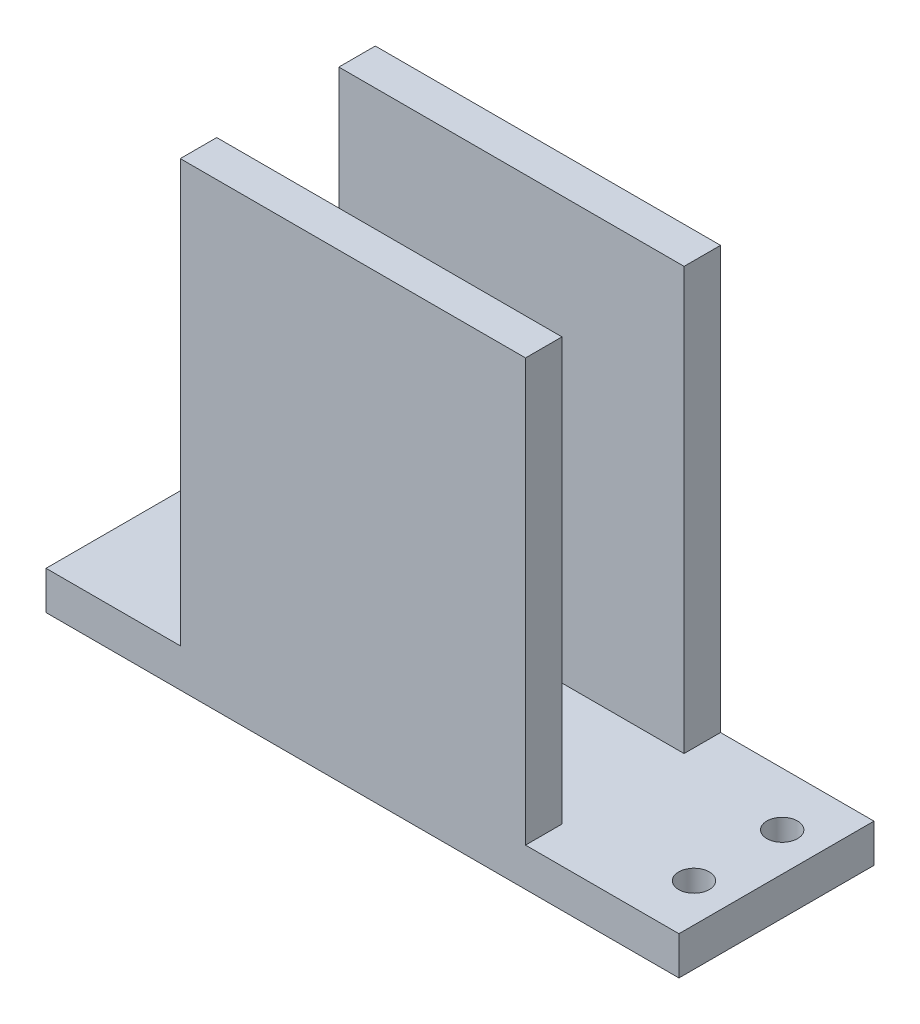
ISO-10303-21;
HEADER;
FILE_DESCRIPTION(('STEP AP214'),'2;1');
FILE_NAME('part.step','',(''),(''),'','','');
FILE_SCHEMA(('AUTOMOTIVE_DESIGN { 1 0 10303 214 1 1 1 1 }'));
ENDSEC;
DATA;
#1=APPLICATION_CONTEXT('core data for automotive mechanical design processes');
#2=APPLICATION_PROTOCOL_DEFINITION('international standard','automotive_design',2000,#1);
#3=PRODUCT_CONTEXT('',#1,'mechanical');
#4=PRODUCT('Part','Part','',(#3));
#5=PRODUCT_RELATED_PRODUCT_CATEGORY('part','',(#4));
#6=PRODUCT_DEFINITION_FORMATION('','',#4);
#7=PRODUCT_DEFINITION_CONTEXT('part definition',#1,'design');
#8=PRODUCT_DEFINITION('design','',#6,#7);
#9=PRODUCT_DEFINITION_SHAPE('','',#8);
#10=(LENGTH_UNIT() NAMED_UNIT(*) SI_UNIT(.MILLI.,.METRE.));
#11=(NAMED_UNIT(*) PLANE_ANGLE_UNIT() SI_UNIT($,.RADIAN.));
#12=(NAMED_UNIT(*) SI_UNIT($,.STERADIAN.) SOLID_ANGLE_UNIT());
#13=UNCERTAINTY_MEASURE_WITH_UNIT(LENGTH_MEASURE(1.E-05),#10,'distance_accuracy_value','');
#14=(GEOMETRIC_REPRESENTATION_CONTEXT(3) GLOBAL_UNCERTAINTY_ASSIGNED_CONTEXT((#13)) GLOBAL_UNIT_ASSIGNED_CONTEXT((#10,
#11,#12)) REPRESENTATION_CONTEXT('',''));
#15=CARTESIAN_POINT('',(0.,0.,0.));
#16=DIRECTION('',(0.,0.,1.));
#17=DIRECTION('',(1.,0.,0.));
#18=AXIS2_PLACEMENT_3D('',#15,#16,#17);
#19=CARTESIAN_POINT('',(125.,120.,-40.84));
#20=DIRECTION('',(-1.,0.,0.));
#21=DIRECTION('',(0.,0.,1.));
#22=AXIS2_PLACEMENT_3D('',#19,#20,#21);
#23=PLANE('',#22);
#24=DIRECTION('',(0.,-1.,0.));
#25=VECTOR('',#24,1.);
#26=CARTESIAN_POINT('',(125.,120.,-41.34));
#27=LINE('',#26,#25);
#28=CARTESIAN_POINT('',(125.,120.,-41.34));
#29=VERTEX_POINT('',#28);
#30=CARTESIAN_POINT('',(125.,10.,-41.34));
#31=VERTEX_POINT('',#30);
#32=EDGE_CURVE('E52',#29,#31,#27,.T.);
#33=ORIENTED_EDGE('',*,*,#32,.T.);
#34=DIRECTION('',(0.,0.,-1.));
#35=VECTOR('',#34,1.);
#36=CARTESIAN_POINT('',(125.,10.,-40.84));
#37=LINE('',#36,#35);
#38=CARTESIAN_POINT('',(125.,10.,-50.84));
#39=VERTEX_POINT('',#38);
#40=EDGE_CURVE('E153',#31,#39,#37,.T.);
#41=ORIENTED_EDGE('',*,*,#40,.T.);
#42=DIRECTION('',(0.,-1.,0.));
#43=VECTOR('',#42,1.);
#44=CARTESIAN_POINT('',(125.,120.,-50.84));
#45=LINE('',#44,#43);
#46=CARTESIAN_POINT('',(125.,120.,-50.84));
#47=VERTEX_POINT('',#46);
#48=EDGE_CURVE('E147',#47,#39,#45,.T.);
#49=ORIENTED_EDGE('',*,*,#48,.F.);
#50=DIRECTION('',(0.,0.,-1.));
#51=VECTOR('',#50,1.);
#52=CARTESIAN_POINT('',(125.,120.,-40.84));
#53=LINE('',#52,#51);
#54=EDGE_CURVE('E149',#29,#47,#53,.T.);
#55=ORIENTED_EDGE('',*,*,#54,.F.);
#56=EDGE_LOOP('',(#33,#41,#49,#55));
#57=FACE_BOUND('',#56,.T.);
#58=ADVANCED_FACE('F35',(#57),#23,.F.);
#59=CARTESIAN_POINT('',(35.,120.,-50.84));
#60=DIRECTION('',(1.,0.,0.));
#61=DIRECTION('',(0.,0.,-1.));
#62=AXIS2_PLACEMENT_3D('',#59,#60,#61);
#63=PLANE('',#62);
#64=DIRECTION('',(0.,1.,0.));
#65=VECTOR('',#64,1.);
#66=CARTESIAN_POINT('',(35.,120.,-41.3400000000001));
#67=LINE('',#66,#65);
#68=CARTESIAN_POINT('',(35.,10.,-41.3400000000001));
#69=VERTEX_POINT('',#68);
#70=CARTESIAN_POINT('',(35.,120.,-41.3400000000001));
#71=VERTEX_POINT('',#70);
#72=EDGE_CURVE('E127',#69,#71,#67,.T.);
#73=ORIENTED_EDGE('',*,*,#72,.T.);
#74=DIRECTION('',(0.,0.,1.));
#75=VECTOR('',#74,1.);
#76=CARTESIAN_POINT('',(35.,120.,-50.84));
#77=LINE('',#76,#75);
#78=CARTESIAN_POINT('',(35.,120.,-50.84));
#79=VERTEX_POINT('',#78);
#80=EDGE_CURVE('E137',#79,#71,#77,.T.);
#81=ORIENTED_EDGE('',*,*,#80,.F.);
#82=DIRECTION('',(0.,-1.,0.));
#83=VECTOR('',#82,1.);
#84=CARTESIAN_POINT('',(35.,120.,-50.84));
#85=LINE('',#84,#83);
#86=CARTESIAN_POINT('',(35.,10.,-50.84));
#87=VERTEX_POINT('',#86);
#88=EDGE_CURVE('E145',#79,#87,#85,.T.);
#89=ORIENTED_EDGE('',*,*,#88,.T.);
#90=DIRECTION('',(0.,0.,1.));
#91=VECTOR('',#90,1.);
#92=CARTESIAN_POINT('',(35.,10.,-50.84));
#93=LINE('',#92,#91);
#94=EDGE_CURVE('E138',#87,#69,#93,.T.);
#95=ORIENTED_EDGE('',*,*,#94,.T.);
#96=EDGE_LOOP('',(#73,#81,#89,#95));
#97=FACE_BOUND('',#96,.T.);
#98=ADVANCED_FACE('F135',(#97),#63,.F.);
#99=CARTESIAN_POINT('',(0.,120.,0.));
#100=DIRECTION('',(0.,-1.,0.));
#101=DIRECTION('',(0.,0.,-1.));
#102=AXIS2_PLACEMENT_3D('',#99,#100,#101);
#103=PLANE('',#102);
#104=DIRECTION('',(1.,0.,0.));
#105=VECTOR('',#104,1.);
#106=CARTESIAN_POINT('',(125.,120.,-41.34));
#107=LINE('',#106,#105);
#108=EDGE_CURVE('E124',#71,#29,#107,.T.);
#109=ORIENTED_EDGE('',*,*,#108,.T.);
#110=ORIENTED_EDGE('',*,*,#54,.T.);
#111=DIRECTION('',(-1.,0.,0.));
#112=VECTOR('',#111,1.);
#113=CARTESIAN_POINT('',(35.,120.,-50.84));
#114=LINE('',#113,#112);
#115=EDGE_CURVE('E143',#47,#79,#114,.T.);
#116=ORIENTED_EDGE('',*,*,#115,.T.);
#117=ORIENTED_EDGE('',*,*,#80,.T.);
#118=EDGE_LOOP('',(#109,#110,#116,#117));
#119=FACE_BOUND('',#118,.T.);
#120=ADVANCED_FACE('F141',(#119),#103,.F.);
#121=CARTESIAN_POINT('',(35.,120.,0.));
#122=DIRECTION('',(1.,0.,0.));
#123=DIRECTION('',(0.,0.,-1.));
#124=AXIS2_PLACEMENT_3D('',#121,#122,#123);
#125=PLANE('',#124);
#126=DIRECTION('',(0.,1.,0.));
#127=VECTOR('',#126,1.);
#128=CARTESIAN_POINT('',(35.,120.,-9.49999999999995));
#129=LINE('',#128,#127);
#130=CARTESIAN_POINT('',(35.,10.,-9.49999999999995));
#131=VERTEX_POINT('',#130);
#132=CARTESIAN_POINT('',(35.,120.,-9.49999999999996));
#133=VERTEX_POINT('',#132);
#134=EDGE_CURVE('E60',#131,#133,#129,.T.);
#135=ORIENTED_EDGE('',*,*,#134,.F.);
#136=DIRECTION('',(0.,0.,1.));
#137=VECTOR('',#136,1.);
#138=CARTESIAN_POINT('',(35.,10.,0.));
#139=LINE('',#138,#137);
#140=CARTESIAN_POINT('',(35.,10.,0.));
#141=VERTEX_POINT('',#140);
#142=EDGE_CURVE('E195',#131,#141,#139,.T.);
#143=ORIENTED_EDGE('',*,*,#142,.T.);
#144=DIRECTION('',(0.,-1.,0.));
#145=VECTOR('',#144,1.);
#146=CARTESIAN_POINT('',(35.,120.,0.));
#147=LINE('',#146,#145);
#148=CARTESIAN_POINT('',(35.,120.,0.));
#149=VERTEX_POINT('',#148);
#150=EDGE_CURVE('E155',#149,#141,#147,.T.);
#151=ORIENTED_EDGE('',*,*,#150,.F.);
#152=DIRECTION('',(0.,0.,1.));
#153=VECTOR('',#152,1.);
#154=CARTESIAN_POINT('',(35.,120.,0.));
#155=LINE('',#154,#153);
#156=EDGE_CURVE('E218',#133,#149,#155,.T.);
#157=ORIENTED_EDGE('',*,*,#156,.F.);
#158=EDGE_LOOP('',(#135,#143,#151,#157));
#159=FACE_BOUND('',#158,.T.);
#160=ADVANCED_FACE('F277',(#159),#125,.F.);
#161=CARTESIAN_POINT('',(125.,120.,-9.99999999999997));
#162=DIRECTION('',(-1.,0.,0.));
#163=DIRECTION('',(0.,0.,1.));
#164=AXIS2_PLACEMENT_3D('',#161,#162,#163);
#165=PLANE('',#164);
#166=DIRECTION('',(0.,-1.,0.));
#167=VECTOR('',#166,1.);
#168=CARTESIAN_POINT('',(125.,120.,-9.49999999999997));
#169=LINE('',#168,#167);
#170=CARTESIAN_POINT('',(125.,120.,-9.49999999999997));
#171=VERTEX_POINT('',#170);
#172=CARTESIAN_POINT('',(125.,10.,-9.49999999999997));
#173=VERTEX_POINT('',#172);
#174=EDGE_CURVE('E254',#171,#173,#169,.T.);
#175=ORIENTED_EDGE('',*,*,#174,.F.);
#176=DIRECTION('',(0.,0.,-1.));
#177=VECTOR('',#176,1.);
#178=CARTESIAN_POINT('',(125.,120.,-9.99999999999997));
#179=LINE('',#178,#177);
#180=CARTESIAN_POINT('',(125.,120.,0.));
#181=VERTEX_POINT('',#180);
#182=EDGE_CURVE('E223',#181,#171,#179,.T.);
#183=ORIENTED_EDGE('',*,*,#182,.F.);
#184=DIRECTION('',(0.,-1.,0.));
#185=VECTOR('',#184,1.);
#186=CARTESIAN_POINT('',(125.,120.,0.));
#187=LINE('',#186,#185);
#188=CARTESIAN_POINT('',(125.,10.,0.));
#189=VERTEX_POINT('',#188);
#190=EDGE_CURVE('E226',#181,#189,#187,.T.);
#191=ORIENTED_EDGE('',*,*,#190,.T.);
#192=DIRECTION('',(0.,0.,-1.));
#193=VECTOR('',#192,1.);
#194=CARTESIAN_POINT('',(125.,10.,-9.99999999999997));
#195=LINE('',#194,#193);
#196=EDGE_CURVE('E221',#189,#173,#195,.T.);
#197=ORIENTED_EDGE('',*,*,#196,.T.);
#198=EDGE_LOOP('',(#175,#183,#191,#197));
#199=FACE_BOUND('',#198,.T.);
#200=ADVANCED_FACE('F266',(#199),#165,.F.);
#201=CARTESIAN_POINT('',(0.,120.,0.));
#202=DIRECTION('',(0.,-1.,0.));
#203=DIRECTION('',(0.,0.,-1.));
#204=AXIS2_PLACEMENT_3D('',#201,#202,#203);
#205=PLANE('',#204);
#206=DIRECTION('',(1.,0.,0.));
#207=VECTOR('',#206,1.);
#208=CARTESIAN_POINT('',(125.,120.,-9.49999999999997));
#209=LINE('',#208,#207);
#210=EDGE_CURVE('E209',#133,#171,#209,.T.);
#211=ORIENTED_EDGE('',*,*,#210,.F.);
#212=ORIENTED_EDGE('',*,*,#156,.T.);
#213=DIRECTION('',(1.,0.,0.));
#214=VECTOR('',#213,1.);
#215=CARTESIAN_POINT('',(35.,120.,0.));
#216=LINE('',#215,#214);
#217=EDGE_CURVE('E220',#149,#181,#216,.T.);
#218=ORIENTED_EDGE('',*,*,#217,.T.);
#219=ORIENTED_EDGE('',*,*,#182,.T.);
#220=EDGE_LOOP('',(#211,#212,#218,#219));
#221=FACE_BOUND('',#220,.T.);
#222=ADVANCED_FACE('F268',(#221),#205,.F.);
#223=CARTESIAN_POINT('',(0.,10.,0.));
#224=DIRECTION('',(0.,-1.,0.));
#225=DIRECTION('',(0.,0.,-1.));
#226=AXIS2_PLACEMENT_3D('',#223,#224,#225);
#227=PLANE('',#226);
#228=ORIENTED_EDGE('',*,*,#40,.F.);
#229=DIRECTION('',(-1.,0.,0.));
#230=VECTOR('',#229,1.);
#231=CARTESIAN_POINT('',(125.,10.,-41.34));
#232=LINE('',#231,#230);
#233=EDGE_CURVE('E139',#31,#69,#232,.T.);
#234=ORIENTED_EDGE('',*,*,#233,.T.);
#235=ORIENTED_EDGE('',*,*,#94,.F.);
#236=DIRECTION('',(-1.,0.,0.));
#237=VECTOR('',#236,1.);
#238=CARTESIAN_POINT('',(0.,10.,-50.84));
#239=LINE('',#238,#237);
#240=CARTESIAN_POINT('',(0.,10.,-50.84));
#241=VERTEX_POINT('',#240);
#242=EDGE_CURVE('E170',#87,#241,#239,.T.);
#243=ORIENTED_EDGE('',*,*,#242,.T.);
#244=DIRECTION('',(0.,0.,1.));
#245=VECTOR('',#244,1.);
#246=CARTESIAN_POINT('',(0.,10.,0.));
#247=LINE('',#246,#245);
#248=CARTESIAN_POINT('',(0.,10.,0.));
#249=VERTEX_POINT('',#248);
#250=EDGE_CURVE('E160',#241,#249,#247,.T.);
#251=ORIENTED_EDGE('',*,*,#250,.T.);
#252=DIRECTION('',(1.,0.,0.));
#253=VECTOR('',#252,1.);
#254=CARTESIAN_POINT('',(0.,10.,0.));
#255=LINE('',#254,#253);
#256=EDGE_CURVE('E165',#249,#141,#255,.T.);
#257=ORIENTED_EDGE('',*,*,#256,.T.);
#258=ORIENTED_EDGE('',*,*,#142,.F.);
#259=DIRECTION('',(-1.,0.,0.));
#260=VECTOR('',#259,1.);
#261=CARTESIAN_POINT('',(125.,10.,-9.49999999999997));
#262=LINE('',#261,#260);
#263=EDGE_CURVE('E257',#173,#131,#262,.T.);
#264=ORIENTED_EDGE('',*,*,#263,.F.);
#265=ORIENTED_EDGE('',*,*,#196,.F.);
#266=CARTESIAN_POINT('',(165.,10.,0.));
#267=VERTEX_POINT('',#266);
#268=EDGE_CURVE('E163',#189,#267,#255,.T.);
#269=ORIENTED_EDGE('',*,*,#268,.T.);
#270=DIRECTION('',(0.,0.,-1.));
#271=VECTOR('',#270,1.);
#272=CARTESIAN_POINT('',(165.,10.,0.));
#273=LINE('',#272,#271);
#274=CARTESIAN_POINT('',(165.,10.,-50.84));
#275=VERTEX_POINT('',#274);
#276=EDGE_CURVE('E168',#267,#275,#273,.T.);
#277=ORIENTED_EDGE('',*,*,#276,.T.);
#278=EDGE_CURVE('E171',#275,#39,#239,.T.);
#279=ORIENTED_EDGE('',*,*,#278,.T.);
#280=EDGE_LOOP('',(#228,#234,#235,#243,#251,#257,#258,#264,#265,#269,#277,#279));
#281=FACE_BOUND('',#280,.T.);
#282=CARTESIAN_POINT('',(30.,10.,-13.92));
#283=DIRECTION('',(0.,-1.,0.));
#284=DIRECTION('',(0.,0.,-1.));
#285=AXIS2_PLACEMENT_3D('',#282,#283,#284);
#286=CIRCLE('',#285,4.00000000000001);
#287=CARTESIAN_POINT('',(30.,10.,-17.92));
#288=VERTEX_POINT('',#287);
#289=EDGE_CURVE('E198',#288,#288,#286,.T.);
#290=ORIENTED_EDGE('',*,*,#289,.T.);
#291=EDGE_LOOP('',(#290));
#292=FACE_BOUND('',#291,.T.);
#293=CARTESIAN_POINT('',(155.,10.,-13.92));
#294=DIRECTION('',(0.,-1.,0.));
#295=DIRECTION('',(0.,0.,-1.));
#296=AXIS2_PLACEMENT_3D('',#293,#294,#295);
#297=CIRCLE('',#296,3.99999999999999);
#298=CARTESIAN_POINT('',(155.,10.,-17.92));
#299=VERTEX_POINT('',#298);
#300=EDGE_CURVE('E204',#299,#299,#297,.T.);
#301=ORIENTED_EDGE('',*,*,#300,.T.);
#302=EDGE_LOOP('',(#301));
#303=FACE_BOUND('',#302,.T.);
#304=CARTESIAN_POINT('',(30.,10.,-36.92));
#305=DIRECTION('',(0.,1.,0.));
#306=DIRECTION('',(0.,0.,1.));
#307=AXIS2_PLACEMENT_3D('',#304,#305,#306);
#308=CIRCLE('',#307,4.00000000000001);
#309=CARTESIAN_POINT('',(30.,10.,-32.92));
#310=VERTEX_POINT('',#309);
#311=EDGE_CURVE('E193',#310,#310,#308,.T.);
#312=ORIENTED_EDGE('',*,*,#311,.F.);
#313=EDGE_LOOP('',(#312));
#314=FACE_BOUND('',#313,.T.);
#315=CARTESIAN_POINT('',(155.,10.,-36.92));
#316=DIRECTION('',(0.,1.,0.));
#317=DIRECTION('',(0.,0.,1.));
#318=AXIS2_PLACEMENT_3D('',#315,#316,#317);
#319=CIRCLE('',#318,3.99999999999999);
#320=CARTESIAN_POINT('',(155.,10.,-32.92));
#321=VERTEX_POINT('',#320);
#322=EDGE_CURVE('E202',#321,#321,#319,.T.);
#323=ORIENTED_EDGE('',*,*,#322,.F.);
#324=EDGE_LOOP('',(#323));
#325=FACE_BOUND('',#324,.T.);
#326=ADVANCED_FACE('F241',(#281,#292,#303,#314,#325),#227,.F.);
#327=CARTESIAN_POINT('',(0.,10.,0.));
#328=DIRECTION('',(1.,0.,0.));
#329=DIRECTION('',(0.,0.,-1.));
#330=AXIS2_PLACEMENT_3D('',#327,#328,#329);
#331=PLANE('',#330);
#332=DIRECTION('',(0.,0.,1.));
#333=VECTOR('',#332,1.);
#334=CARTESIAN_POINT('',(0.,0.,0.));
#335=LINE('',#334,#333);
#336=CARTESIAN_POINT('',(0.,0.,-50.84));
#337=VERTEX_POINT('',#336);
#338=CARTESIAN_POINT('',(0.,0.,0.));
#339=VERTEX_POINT('',#338);
#340=EDGE_CURVE('E159',#337,#339,#335,.T.);
#341=ORIENTED_EDGE('',*,*,#340,.T.);
#342=DIRECTION('',(0.,-1.,0.));
#343=VECTOR('',#342,1.);
#344=CARTESIAN_POINT('',(0.,10.,0.));
#345=LINE('',#344,#343);
#346=EDGE_CURVE('E11',#249,#339,#345,.T.);
#347=ORIENTED_EDGE('',*,*,#346,.F.);
#348=ORIENTED_EDGE('',*,*,#250,.F.);
#349=DIRECTION('',(0.,-1.,0.));
#350=VECTOR('',#349,1.);
#351=CARTESIAN_POINT('',(0.,10.,-50.84));
#352=LINE('',#351,#350);
#353=EDGE_CURVE('E174',#241,#337,#352,.T.);
#354=ORIENTED_EDGE('',*,*,#353,.T.);
#355=EDGE_LOOP('',(#341,#347,#348,#354));
#356=FACE_BOUND('',#355,.T.);
#357=ADVANCED_FACE('F37',(#356),#331,.F.);
#358=CARTESIAN_POINT('',(0.,10.,0.));
#359=DIRECTION('',(0.,0.,-1.));
#360=DIRECTION('',(-1.,0.,0.));
#361=AXIS2_PLACEMENT_3D('',#358,#359,#360);
#362=PLANE('',#361);
#363=DIRECTION('',(1.,0.,0.));
#364=VECTOR('',#363,1.);
#365=CARTESIAN_POINT('',(0.,0.,0.));
#366=LINE('',#365,#364);
#367=CARTESIAN_POINT('',(165.,0.,0.));
#368=VERTEX_POINT('',#367);
#369=EDGE_CURVE('E177',#339,#368,#366,.T.);
#370=ORIENTED_EDGE('',*,*,#369,.T.);
#371=DIRECTION('',(0.,-1.,0.));
#372=VECTOR('',#371,1.);
#373=CARTESIAN_POINT('',(165.,10.,0.));
#374=LINE('',#373,#372);
#375=EDGE_CURVE('E44',#267,#368,#374,.T.);
#376=ORIENTED_EDGE('',*,*,#375,.F.);
#377=ORIENTED_EDGE('',*,*,#268,.F.);
#378=ORIENTED_EDGE('',*,*,#190,.F.);
#379=ORIENTED_EDGE('',*,*,#217,.F.);
#380=ORIENTED_EDGE('',*,*,#150,.T.);
#381=ORIENTED_EDGE('',*,*,#256,.F.);
#382=ORIENTED_EDGE('',*,*,#346,.T.);
#383=EDGE_LOOP('',(#370,#376,#377,#378,#379,#380,#381,#382));
#384=FACE_BOUND('',#383,.T.);
#385=ADVANCED_FACE('F273',(#384),#362,.F.);
#386=CARTESIAN_POINT('',(165.,10.,0.));
#387=DIRECTION('',(-1.,0.,0.));
#388=DIRECTION('',(0.,0.,1.));
#389=AXIS2_PLACEMENT_3D('',#386,#387,#388);
#390=PLANE('',#389);
#391=DIRECTION('',(0.,0.,-1.));
#392=VECTOR('',#391,1.);
#393=CARTESIAN_POINT('',(165.,0.,0.));
#394=LINE('',#393,#392);
#395=CARTESIAN_POINT('',(165.,0.,-50.84));
#396=VERTEX_POINT('',#395);
#397=EDGE_CURVE('E179',#368,#396,#394,.T.);
#398=ORIENTED_EDGE('',*,*,#397,.T.);
#399=DIRECTION('',(0.,-1.,0.));
#400=VECTOR('',#399,1.);
#401=CARTESIAN_POINT('',(165.,10.,-50.84));
#402=LINE('',#401,#400);
#403=EDGE_CURVE('E184',#275,#396,#402,.T.);
#404=ORIENTED_EDGE('',*,*,#403,.F.);
#405=ORIENTED_EDGE('',*,*,#276,.F.);
#406=ORIENTED_EDGE('',*,*,#375,.T.);
#407=EDGE_LOOP('',(#398,#404,#405,#406));
#408=FACE_BOUND('',#407,.T.);
#409=ADVANCED_FACE('F278',(#408),#390,.F.);
#410=CARTESIAN_POINT('',(0.,10.,-50.84));
#411=DIRECTION('',(0.,0.,1.));
#412=DIRECTION('',(1.,0.,0.));
#413=AXIS2_PLACEMENT_3D('',#410,#411,#412);
#414=PLANE('',#413);
#415=DIRECTION('',(-1.,0.,0.));
#416=VECTOR('',#415,1.);
#417=CARTESIAN_POINT('',(0.,0.,-50.84));
#418=LINE('',#417,#416);
#419=EDGE_CURVE('E164',#396,#337,#418,.T.);
#420=ORIENTED_EDGE('',*,*,#419,.T.);
#421=ORIENTED_EDGE('',*,*,#353,.F.);
#422=ORIENTED_EDGE('',*,*,#242,.F.);
#423=ORIENTED_EDGE('',*,*,#88,.F.);
#424=ORIENTED_EDGE('',*,*,#115,.F.);
#425=ORIENTED_EDGE('',*,*,#48,.T.);
#426=ORIENTED_EDGE('',*,*,#278,.F.);
#427=ORIENTED_EDGE('',*,*,#403,.T.);
#428=EDGE_LOOP('',(#420,#421,#422,#423,#424,#425,#426,#427));
#429=FACE_BOUND('',#428,.T.);
#430=ADVANCED_FACE('F236',(#429),#414,.F.);
#431=CARTESIAN_POINT('',(0.,0.,0.));
#432=DIRECTION('',(0.,-1.,0.));
#433=DIRECTION('',(0.,0.,-1.));
#434=AXIS2_PLACEMENT_3D('',#431,#432,#433);
#435=PLANE('',#434);
#436=CARTESIAN_POINT('',(30.,0.,-13.92));
#437=DIRECTION('',(0.,-1.,0.));
#438=DIRECTION('',(0.,0.,-1.));
#439=AXIS2_PLACEMENT_3D('',#436,#437,#438);
#440=CIRCLE('',#439,4.00000000000001);
#441=CARTESIAN_POINT('',(30.,0.,-17.92));
#442=VERTEX_POINT('',#441);
#443=EDGE_CURVE('E39',#442,#442,#440,.F.);
#444=ORIENTED_EDGE('',*,*,#443,.T.);
#445=EDGE_LOOP('',(#444));
#446=FACE_BOUND('',#445,.T.);
#447=CARTESIAN_POINT('',(155.,0.,-13.92));
#448=DIRECTION('',(0.,-1.,0.));
#449=DIRECTION('',(0.,0.,-1.));
#450=AXIS2_PLACEMENT_3D('',#447,#448,#449);
#451=CIRCLE('',#450,3.99999999999999);
#452=CARTESIAN_POINT('',(155.,0.,-17.92));
#453=VERTEX_POINT('',#452);
#454=EDGE_CURVE('E196',#453,#453,#451,.F.);
#455=ORIENTED_EDGE('',*,*,#454,.T.);
#456=EDGE_LOOP('',(#455));
#457=FACE_BOUND('',#456,.T.);
#458=CARTESIAN_POINT('',(30.,0.,-36.92));
#459=DIRECTION('',(0.,-1.,0.));
#460=DIRECTION('',(0.,0.,-1.));
#461=AXIS2_PLACEMENT_3D('',#458,#459,#460);
#462=CIRCLE('',#461,4.00000000000001);
#463=CARTESIAN_POINT('',(30.,0.,-40.92));
#464=VERTEX_POINT('',#463);
#465=EDGE_CURVE('E192',#464,#464,#462,.T.);
#466=ORIENTED_EDGE('',*,*,#465,.F.);
#467=EDGE_LOOP('',(#466));
#468=FACE_BOUND('',#467,.T.);
#469=CARTESIAN_POINT('',(155.,0.,-36.92));
#470=DIRECTION('',(0.,-1.,0.));
#471=DIRECTION('',(0.,0.,-1.));
#472=AXIS2_PLACEMENT_3D('',#469,#470,#471);
#473=CIRCLE('',#472,3.99999999999999);
#474=CARTESIAN_POINT('',(155.,0.,-40.92));
#475=VERTEX_POINT('',#474);
#476=EDGE_CURVE('E189',#475,#475,#473,.T.);
#477=ORIENTED_EDGE('',*,*,#476,.F.);
#478=EDGE_LOOP('',(#477));
#479=FACE_BOUND('',#478,.T.);
#480=ORIENTED_EDGE('',*,*,#340,.F.);
#481=ORIENTED_EDGE('',*,*,#419,.F.);
#482=ORIENTED_EDGE('',*,*,#397,.F.);
#483=ORIENTED_EDGE('',*,*,#369,.F.);
#484=EDGE_LOOP('',(#480,#481,#482,#483));
#485=FACE_BOUND('',#484,.T.);
#486=ADVANCED_FACE('F250',(#446,#457,#468,#479,#485),#435,.T.);
#487=CARTESIAN_POINT('',(155.,-20.,-36.92));
#488=DIRECTION('',(0.,1.,0.));
#489=DIRECTION('',(0.,0.,1.));
#490=AXIS2_PLACEMENT_3D('',#487,#488,#489);
#491=CYLINDRICAL_SURFACE('',#490,3.99999999999999);
#492=ORIENTED_EDGE('',*,*,#476,.T.);
#493=EDGE_LOOP('',(#492));
#494=FACE_BOUND('',#493,.T.);
#495=ORIENTED_EDGE('',*,*,#322,.T.);
#496=EDGE_LOOP('',(#495));
#497=FACE_BOUND('',#496,.T.);
#498=ADVANCED_FACE('F297',(#494,#497),#491,.F.);
#499=CARTESIAN_POINT('',(30.,-20.,-36.92));
#500=DIRECTION('',(0.,1.,0.));
#501=DIRECTION('',(0.,0.,1.));
#502=AXIS2_PLACEMENT_3D('',#499,#500,#501);
#503=CYLINDRICAL_SURFACE('',#502,4.00000000000001);
#504=ORIENTED_EDGE('',*,*,#465,.T.);
#505=EDGE_LOOP('',(#504));
#506=FACE_BOUND('',#505,.T.);
#507=ORIENTED_EDGE('',*,*,#311,.T.);
#508=EDGE_LOOP('',(#507));
#509=FACE_BOUND('',#508,.T.);
#510=ADVANCED_FACE('F302',(#506,#509),#503,.F.);
#511=CARTESIAN_POINT('',(155.,-20.,-13.92));
#512=DIRECTION('',(0.,1.,0.));
#513=DIRECTION('',(0.,0.,1.));
#514=AXIS2_PLACEMENT_3D('',#511,#512,#513);
#515=CYLINDRICAL_SURFACE('',#514,3.99999999999999);
#516=ORIENTED_EDGE('',*,*,#454,.F.);
#517=EDGE_LOOP('',(#516));
#518=FACE_BOUND('',#517,.T.);
#519=ORIENTED_EDGE('',*,*,#300,.F.);
#520=EDGE_LOOP('',(#519));
#521=FACE_BOUND('',#520,.T.);
#522=ADVANCED_FACE('F316',(#518,#521),#515,.F.);
#523=CARTESIAN_POINT('',(30.,-20.,-13.92));
#524=DIRECTION('',(0.,1.,0.));
#525=DIRECTION('',(0.,0.,1.));
#526=AXIS2_PLACEMENT_3D('',#523,#524,#525);
#527=CYLINDRICAL_SURFACE('',#526,4.00000000000001);
#528=ORIENTED_EDGE('',*,*,#443,.F.);
#529=EDGE_LOOP('',(#528));
#530=FACE_BOUND('',#529,.T.);
#531=ORIENTED_EDGE('',*,*,#289,.F.);
#532=EDGE_LOOP('',(#531));
#533=FACE_BOUND('',#532,.T.);
#534=ADVANCED_FACE('F323',(#530,#533),#527,.F.);
#535=CARTESIAN_POINT('',(0.,0.,-9.49999999999994));
#536=DIRECTION('',(0.,0.,-1.));
#537=DIRECTION('',(-1.,0.,0.));
#538=AXIS2_PLACEMENT_3D('',#535,#536,#537);
#539=PLANE('',#538);
#540=ORIENTED_EDGE('',*,*,#174,.T.);
#541=ORIENTED_EDGE('',*,*,#263,.T.);
#542=ORIENTED_EDGE('',*,*,#134,.T.);
#543=ORIENTED_EDGE('',*,*,#210,.T.);
#544=EDGE_LOOP('',(#540,#541,#542,#543));
#545=FACE_BOUND('',#544,.T.);
#546=ADVANCED_FACE('F261',(#545),#539,.T.);
#547=CARTESIAN_POINT('',(0.,0.,-41.3400000000001));
#548=DIRECTION('',(0.,0.,1.));
#549=DIRECTION('',(-1.,0.,0.));
#550=AXIS2_PLACEMENT_3D('',#547,#548,#549);
#551=PLANE('',#550);
#552=ORIENTED_EDGE('',*,*,#32,.F.);
#553=ORIENTED_EDGE('',*,*,#108,.F.);
#554=ORIENTED_EDGE('',*,*,#72,.F.);
#555=ORIENTED_EDGE('',*,*,#233,.F.);
#556=EDGE_LOOP('',(#552,#553,#554,#555));
#557=FACE_BOUND('',#556,.T.);
#558=ADVANCED_FACE('F126',(#557),#551,.T.);
#559=CLOSED_SHELL('',(#58,#98,#120,#160,#200,#222,#326,#357,#385,#409,#430,#486,#498,#510,#522,
#534,#546,#558));
#560=MANIFOLD_SOLID_BREP('B2',#559);
#561=ADVANCED_BREP_SHAPE_REPRESENTATION('',(#18,#560),#14);
#562=SHAPE_DEFINITION_REPRESENTATION(#9,#561);
ENDSEC;
END-ISO-10303-21;
